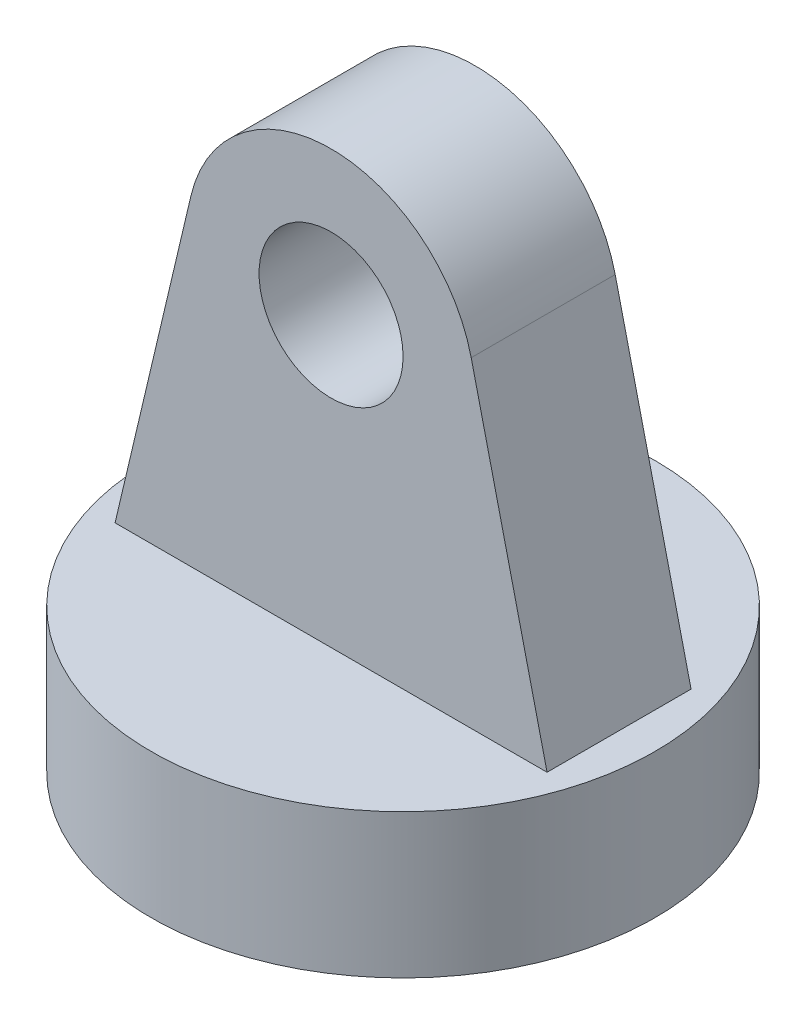
ISO-10303-21;
HEADER;
FILE_DESCRIPTION(('STEP AP214'),'2;1');
FILE_NAME('part.step','',(''),(''),'','','');
FILE_SCHEMA(('AUTOMOTIVE_DESIGN { 1 0 10303 214 1 1 1 1 }'));
ENDSEC;
DATA;
#1=APPLICATION_CONTEXT('core data for automotive mechanical design processes');
#2=APPLICATION_PROTOCOL_DEFINITION('international standard','automotive_design',2000,#1);
#3=PRODUCT_CONTEXT('',#1,'mechanical');
#4=PRODUCT('Part','Part','',(#3));
#5=PRODUCT_RELATED_PRODUCT_CATEGORY('part','',(#4));
#6=PRODUCT_DEFINITION_FORMATION('','',#4);
#7=PRODUCT_DEFINITION_CONTEXT('part definition',#1,'design');
#8=PRODUCT_DEFINITION('design','',#6,#7);
#9=PRODUCT_DEFINITION_SHAPE('','',#8);
#10=(LENGTH_UNIT() NAMED_UNIT(*) SI_UNIT(.MILLI.,.METRE.));
#11=(NAMED_UNIT(*) PLANE_ANGLE_UNIT() SI_UNIT($,.RADIAN.));
#12=(NAMED_UNIT(*) SI_UNIT($,.STERADIAN.) SOLID_ANGLE_UNIT());
#13=UNCERTAINTY_MEASURE_WITH_UNIT(LENGTH_MEASURE(1.E-05),#10,'distance_accuracy_value','');
#14=(GEOMETRIC_REPRESENTATION_CONTEXT(3) GLOBAL_UNCERTAINTY_ASSIGNED_CONTEXT((#13)) GLOBAL_UNIT_ASSIGNED_CONTEXT((#10,
#11,#12)) REPRESENTATION_CONTEXT('',''));
#15=CARTESIAN_POINT('',(0.,0.,0.));
#16=DIRECTION('',(0.,0.,1.));
#17=DIRECTION('',(1.,0.,0.));
#18=AXIS2_PLACEMENT_3D('',#15,#16,#17);
#19=CARTESIAN_POINT('',(0.,0.,10.));
#20=DIRECTION('',(0.,0.,1.));
#21=DIRECTION('',(1.,0.,0.));
#22=AXIS2_PLACEMENT_3D('',#19,#20,#21);
#23=PLANE('',#22);
#24=CARTESIAN_POINT('',(4.46260575810842,305.164077124258,10.));
#25=DIRECTION('',(0.,0.,1.));
#26=DIRECTION('',(1.,0.,0.));
#27=AXIS2_PLACEMENT_3D('',#24,#25,#26);
#28=CIRCLE('',#27,5.00000000000001);
#29=CARTESIAN_POINT('',(9.46260575810842,305.164077124258,10.));
#30=VERTEX_POINT('',#29);
#31=EDGE_CURVE('E90',#30,#30,#28,.T.);
#32=ORIENTED_EDGE('',*,*,#31,.F.);
#33=EDGE_LOOP('',(#32));
#34=FACE_BOUND('',#33,.T.);
#35=DIRECTION('',(0.2299090833947,0.973212111192935,0.));
#36=VECTOR('',#35,1.);
#37=CARTESIAN_POINT('',(-73.7859557603921,17.4310011776154,10.));
#38=LINE('',#37,#36);
#39=CARTESIAN_POINT('',(-10.5373942418916,285.164077124258,10.));
#40=VERTEX_POINT('',#39);
#41=CARTESIAN_POINT('',(-5.26951535382094,307.463167958205,10.));
#42=VERTEX_POINT('',#41);
#43=EDGE_CURVE('E116',#40,#42,#38,.T.);
#44=ORIENTED_EDGE('',*,*,#43,.F.);
#45=DIRECTION('',(1.,0.,0.));
#46=VECTOR('',#45,1.);
#47=CARTESIAN_POINT('',(0.,285.164077124258,10.));
#48=LINE('',#47,#46);
#49=CARTESIAN_POINT('',(19.4626057581084,285.164077124258,10.));
#50=VERTEX_POINT('',#49);
#51=EDGE_CURVE('E104',#40,#50,#48,.T.);
#52=ORIENTED_EDGE('',*,*,#51,.T.);
#53=DIRECTION('',(-0.2299090833947,0.973212111192935,0.));
#54=VECTOR('',#53,1.);
#55=CARTESIAN_POINT('',(82.2393967805959,19.4280199714978,10.));
#56=LINE('',#55,#54);
#57=CARTESIAN_POINT('',(14.1947268700378,307.463167958205,10.));
#58=VERTEX_POINT('',#57);
#59=EDGE_CURVE('E58',#50,#58,#56,.T.);
#60=ORIENTED_EDGE('',*,*,#59,.T.);
#61=CARTESIAN_POINT('',(4.46260575810842,305.164077124258,10.));
#62=DIRECTION('',(0.,0.,1.));
#63=DIRECTION('',(1.,0.,0.));
#64=AXIS2_PLACEMENT_3D('',#61,#62,#63);
#65=CIRCLE('',#64,10.);
#66=EDGE_CURVE('E82',#58,#42,#65,.T.);
#67=ORIENTED_EDGE('',*,*,#66,.T.);
#68=EDGE_LOOP('',(#44,#52,#60,#67));
#69=FACE_BOUND('',#68,.T.);
#70=ADVANCED_FACE('F41',(#34,#69),#23,.T.);
#71=CARTESIAN_POINT('',(0.,0.,0.));
#72=DIRECTION('',(0.,0.,1.));
#73=DIRECTION('',(1.,0.,0.));
#74=AXIS2_PLACEMENT_3D('',#71,#72,#73);
#75=PLANE('',#74);
#76=CARTESIAN_POINT('',(4.46260575810842,305.164077124258,0.));
#77=DIRECTION('',(0.,0.,1.));
#78=DIRECTION('',(1.,0.,0.));
#79=AXIS2_PLACEMENT_3D('',#76,#77,#78);
#80=CIRCLE('',#79,5.00000000000001);
#81=CARTESIAN_POINT('',(9.46260575810842,305.164077124258,0.));
#82=VERTEX_POINT('',#81);
#83=EDGE_CURVE('E112',#82,#82,#80,.T.);
#84=ORIENTED_EDGE('',*,*,#83,.T.);
#85=EDGE_LOOP('',(#84));
#86=FACE_BOUND('',#85,.T.);
#87=DIRECTION('',(1.,0.,0.));
#88=VECTOR('',#87,1.);
#89=CARTESIAN_POINT('',(0.,285.164077124258,0.));
#90=LINE('',#89,#88);
#91=CARTESIAN_POINT('',(-10.5373942418916,285.164077124258,0.));
#92=VERTEX_POINT('',#91);
#93=CARTESIAN_POINT('',(19.4626057581084,285.164077124258,0.));
#94=VERTEX_POINT('',#93);
#95=EDGE_CURVE('E11',#92,#94,#90,.T.);
#96=ORIENTED_EDGE('',*,*,#95,.F.);
#97=DIRECTION('',(0.2299090833947,0.973212111192935,0.));
#98=VECTOR('',#97,1.);
#99=CARTESIAN_POINT('',(-73.7859557603921,17.4310011776154,0.));
#100=LINE('',#99,#98);
#101=CARTESIAN_POINT('',(-5.26951535382094,307.463167958205,0.));
#102=VERTEX_POINT('',#101);
#103=EDGE_CURVE('E91',#92,#102,#100,.T.);
#104=ORIENTED_EDGE('',*,*,#103,.T.);
#105=CARTESIAN_POINT('',(4.46260575810842,305.164077124258,0.));
#106=DIRECTION('',(0.,0.,1.));
#107=DIRECTION('',(1.,0.,0.));
#108=AXIS2_PLACEMENT_3D('',#105,#106,#107);
#109=CIRCLE('',#108,10.);
#110=CARTESIAN_POINT('',(14.1947268700378,307.463167958205,0.));
#111=VERTEX_POINT('',#110);
#112=EDGE_CURVE('E89',#111,#102,#109,.T.);
#113=ORIENTED_EDGE('',*,*,#112,.F.);
#114=DIRECTION('',(-0.2299090833947,0.973212111192935,0.));
#115=VECTOR('',#114,1.);
#116=CARTESIAN_POINT('',(82.2393967805959,19.4280199714978,0.));
#117=LINE('',#116,#115);
#118=EDGE_CURVE('E77',#94,#111,#117,.T.);
#119=ORIENTED_EDGE('',*,*,#118,.F.);
#120=EDGE_LOOP('',(#96,#104,#113,#119));
#121=FACE_BOUND('',#120,.T.);
#122=ADVANCED_FACE('F87',(#86,#121),#75,.F.);
#123=CARTESIAN_POINT('',(4.46260575810842,305.164077124258,10.));
#124=DIRECTION('',(0.,0.,-1.));
#125=DIRECTION('',(-1.,0.,0.));
#126=AXIS2_PLACEMENT_3D('',#123,#124,#125);
#127=CYLINDRICAL_SURFACE('',#126,10.);
#128=ORIENTED_EDGE('',*,*,#112,.T.);
#129=DIRECTION('',(0.,0.,-1.));
#130=VECTOR('',#129,1.);
#131=CARTESIAN_POINT('',(-5.26951535382094,307.463167958205,10.));
#132=LINE('',#131,#130);
#133=EDGE_CURVE('E50',#42,#102,#132,.T.);
#134=ORIENTED_EDGE('',*,*,#133,.F.);
#135=ORIENTED_EDGE('',*,*,#66,.F.);
#136=DIRECTION('',(0.,0.,-1.));
#137=VECTOR('',#136,1.);
#138=CARTESIAN_POINT('',(14.1947268700378,307.463167958205,10.));
#139=LINE('',#138,#137);
#140=EDGE_CURVE('E99',#58,#111,#139,.T.);
#141=ORIENTED_EDGE('',*,*,#140,.T.);
#142=EDGE_LOOP('',(#128,#134,#135,#141));
#143=FACE_BOUND('',#142,.T.);
#144=ADVANCED_FACE('F144',(#143),#127,.T.);
#145=CARTESIAN_POINT('',(-73.7859557603921,17.4310011776154,10.));
#146=DIRECTION('',(-0.973212111192935,0.2299090833947,0.));
#147=DIRECTION('',(-0.2299090833947,-0.973212111192935,0.));
#148=AXIS2_PLACEMENT_3D('',#145,#146,#147);
#149=PLANE('',#148);
#150=ORIENTED_EDGE('',*,*,#103,.F.);
#151=DIRECTION('',(0.,0.,-1.));
#152=VECTOR('',#151,1.);
#153=CARTESIAN_POINT('',(-10.5373942418916,285.164077124258,10.));
#154=LINE('',#153,#152);
#155=EDGE_CURVE('E98',#40,#92,#154,.T.);
#156=ORIENTED_EDGE('',*,*,#155,.F.);
#157=ORIENTED_EDGE('',*,*,#43,.T.);
#158=ORIENTED_EDGE('',*,*,#133,.T.);
#159=EDGE_LOOP('',(#150,#156,#157,#158));
#160=FACE_BOUND('',#159,.T.);
#161=ADVANCED_FACE('F152',(#160),#149,.T.);
#162=CARTESIAN_POINT('',(4.46260575810842,305.164077124258,10.));
#163=DIRECTION('',(0.,0.,-1.));
#164=DIRECTION('',(-1.,0.,0.));
#165=AXIS2_PLACEMENT_3D('',#162,#163,#164);
#166=CYLINDRICAL_SURFACE('',#165,5.00000000000001);
#167=ORIENTED_EDGE('',*,*,#31,.T.);
#168=EDGE_LOOP('',(#167));
#169=FACE_BOUND('',#168,.T.);
#170=ORIENTED_EDGE('',*,*,#83,.F.);
#171=EDGE_LOOP('',(#170));
#172=FACE_BOUND('',#171,.T.);
#173=ADVANCED_FACE('F43',(#169,#172),#166,.F.);
#174=CARTESIAN_POINT('',(82.2393967805959,19.4280199714978,10.));
#175=DIRECTION('',(-0.973212111192935,-0.2299090833947,0.));
#176=DIRECTION('',(0.2299090833947,-0.973212111192935,0.));
#177=AXIS2_PLACEMENT_3D('',#174,#175,#176);
#178=PLANE('',#177);
#179=ORIENTED_EDGE('',*,*,#118,.T.);
#180=ORIENTED_EDGE('',*,*,#140,.F.);
#181=ORIENTED_EDGE('',*,*,#59,.F.);
#182=DIRECTION('',(0.,0.,-1.));
#183=VECTOR('',#182,1.);
#184=CARTESIAN_POINT('',(19.4626057581084,285.164077124258,10.));
#185=LINE('',#184,#183);
#186=EDGE_CURVE('E94',#50,#94,#185,.T.);
#187=ORIENTED_EDGE('',*,*,#186,.T.);
#188=EDGE_LOOP('',(#179,#180,#181,#187));
#189=FACE_BOUND('',#188,.T.);
#190=ADVANCED_FACE('F95',(#189),#178,.F.);
#191=CARTESIAN_POINT('',(4.46260575810842,275.164077124258,5.));
#192=DIRECTION('',(0.,1.,0.));
#193=DIRECTION('',(0.,0.,1.));
#194=AXIS2_PLACEMENT_3D('',#191,#192,#193);
#195=CYLINDRICAL_SURFACE('',#194,17.5);
#196=CARTESIAN_POINT('',(4.46260575810842,275.164077124258,5.));
#197=DIRECTION('',(0.,-1.,0.));
#198=DIRECTION('',(0.,0.,-1.));
#199=AXIS2_PLACEMENT_3D('',#196,#197,#198);
#200=CIRCLE('',#199,17.5);
#201=CARTESIAN_POINT('',(4.46260575810842,275.164077124258,-12.5));
#202=VERTEX_POINT('',#201);
#203=EDGE_CURVE('E122',#202,#202,#200,.T.);
#204=ORIENTED_EDGE('',*,*,#203,.F.);
#205=EDGE_LOOP('',(#204));
#206=FACE_BOUND('',#205,.T.);
#207=CARTESIAN_POINT('',(4.46260575810842,285.164077124258,5.));
#208=DIRECTION('',(0.,-1.,0.));
#209=DIRECTION('',(0.,0.,-1.));
#210=AXIS2_PLACEMENT_3D('',#207,#208,#209);
#211=CIRCLE('',#210,17.5);
#212=CARTESIAN_POINT('',(4.46260575810842,285.164077124258,-12.5));
#213=VERTEX_POINT('',#212);
#214=EDGE_CURVE('E125',#213,#213,#211,.T.);
#215=ORIENTED_EDGE('',*,*,#214,.T.);
#216=EDGE_LOOP('',(#215));
#217=FACE_BOUND('',#216,.T.);
#218=ADVANCED_FACE('F129',(#206,#217),#195,.T.);
#219=CARTESIAN_POINT('',(4.46260575810842,275.164077124258,5.));
#220=DIRECTION('',(0.,-1.,0.));
#221=DIRECTION('',(0.,0.,-1.));
#222=AXIS2_PLACEMENT_3D('',#219,#220,#221);
#223=PLANE('',#222);
#224=ORIENTED_EDGE('',*,*,#203,.T.);
#225=EDGE_LOOP('',(#224));
#226=FACE_BOUND('',#225,.T.);
#227=ADVANCED_FACE('F131',(#226),#223,.T.);
#228=CARTESIAN_POINT('',(4.46260575810842,285.164077124258,5.));
#229=DIRECTION('',(0.,-1.,0.));
#230=DIRECTION('',(0.,0.,-1.));
#231=AXIS2_PLACEMENT_3D('',#228,#229,#230);
#232=PLANE('',#231);
#233=ORIENTED_EDGE('',*,*,#51,.F.);
#234=ORIENTED_EDGE('',*,*,#155,.T.);
#235=ORIENTED_EDGE('',*,*,#95,.T.);
#236=ORIENTED_EDGE('',*,*,#186,.F.);
#237=EDGE_LOOP('',(#233,#234,#235,#236));
#238=FACE_BOUND('',#237,.T.);
#239=ORIENTED_EDGE('',*,*,#214,.F.);
#240=EDGE_LOOP('',(#239));
#241=FACE_BOUND('',#240,.T.);
#242=ADVANCED_FACE('F102',(#238,#241),#232,.F.);
#243=CLOSED_SHELL('',(#70,#122,#144,#161,#173,#190,#218,#227,#242));
#244=MANIFOLD_SOLID_BREP('B2',#243);
#245=ADVANCED_BREP_SHAPE_REPRESENTATION('',(#18,#244),#14);
#246=SHAPE_DEFINITION_REPRESENTATION(#9,#245);
ENDSEC;
END-ISO-10303-21;
